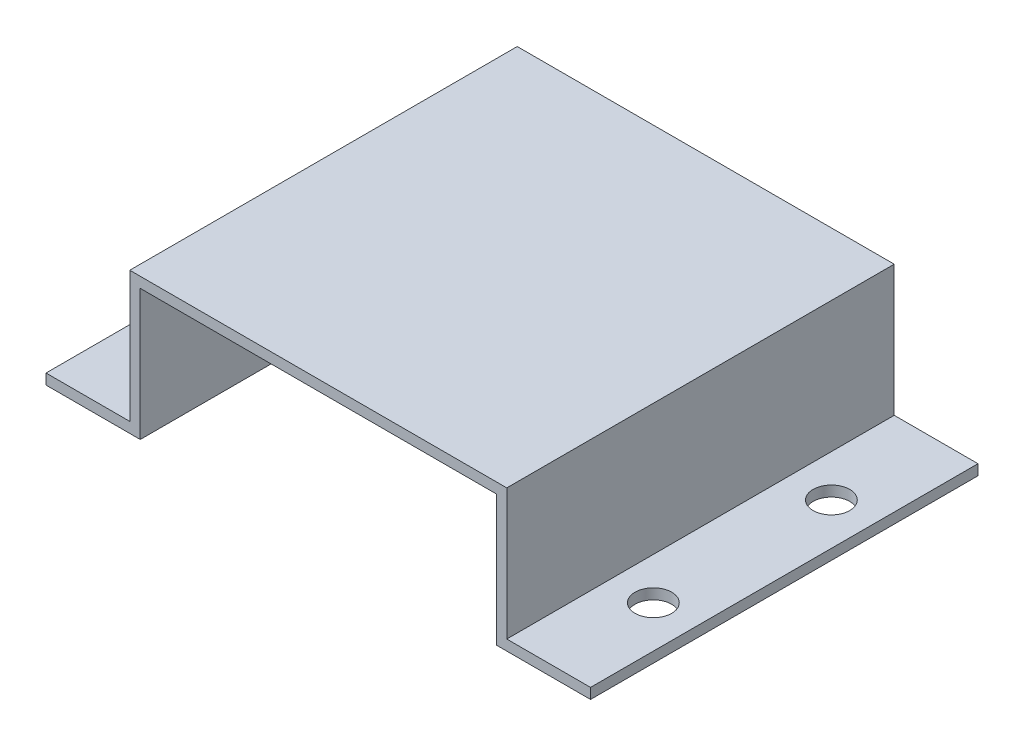
ISO-10303-21;
HEADER;
FILE_DESCRIPTION(('STEP AP214'),'2;1');
FILE_NAME('part.step','',(''),(''),'','','');
FILE_SCHEMA(('AUTOMOTIVE_DESIGN { 1 0 10303 214 1 1 1 1 }'));
ENDSEC;
DATA;
#1=APPLICATION_CONTEXT('core data for automotive mechanical design processes');
#2=APPLICATION_PROTOCOL_DEFINITION('international standard','automotive_design',2000,#1);
#3=PRODUCT_CONTEXT('',#1,'mechanical');
#4=PRODUCT('Part','Part','',(#3));
#5=PRODUCT_RELATED_PRODUCT_CATEGORY('part','',(#4));
#6=PRODUCT_DEFINITION_FORMATION('','',#4);
#7=PRODUCT_DEFINITION_CONTEXT('part definition',#1,'design');
#8=PRODUCT_DEFINITION('design','',#6,#7);
#9=PRODUCT_DEFINITION_SHAPE('','',#8);
#10=(LENGTH_UNIT() NAMED_UNIT(*) SI_UNIT(.MILLI.,.METRE.));
#11=(NAMED_UNIT(*) PLANE_ANGLE_UNIT() SI_UNIT($,.RADIAN.));
#12=(NAMED_UNIT(*) SI_UNIT($,.STERADIAN.) SOLID_ANGLE_UNIT());
#13=UNCERTAINTY_MEASURE_WITH_UNIT(LENGTH_MEASURE(1.E-05),#10,'distance_accuracy_value','');
#14=(GEOMETRIC_REPRESENTATION_CONTEXT(3) GLOBAL_UNCERTAINTY_ASSIGNED_CONTEXT((#13)) GLOBAL_UNIT_ASSIGNED_CONTEXT((#10,
#11,#12)) REPRESENTATION_CONTEXT('',''));
#15=CARTESIAN_POINT('',(0.,0.,0.));
#16=DIRECTION('',(0.,0.,1.));
#17=DIRECTION('',(1.,0.,0.));
#18=AXIS2_PLACEMENT_3D('',#15,#16,#17);
#19=CARTESIAN_POINT('',(0.,11.5,37.));
#20=DIRECTION('',(0.,1.,0.));
#21=DIRECTION('',(0.,0.,1.));
#22=AXIS2_PLACEMENT_3D('',#19,#20,#21);
#23=PLANE('',#22);
#24=DIRECTION('',(1.,0.,0.));
#25=VECTOR('',#24,1.);
#26=CARTESIAN_POINT('',(0.,11.5,0.));
#27=LINE('',#26,#25);
#28=CARTESIAN_POINT('',(0.999999999999999,11.5,0.));
#29=VERTEX_POINT('',#28);
#30=CARTESIAN_POINT('',(35.,11.5,0.));
#31=VERTEX_POINT('',#30);
#32=EDGE_CURVE('E161',#29,#31,#27,.T.);
#33=ORIENTED_EDGE('',*,*,#32,.T.);
#34=DIRECTION('',(0.,0.,-1.));
#35=VECTOR('',#34,1.);
#36=CARTESIAN_POINT('',(35.,11.5,37.));
#37=LINE('',#36,#35);
#38=CARTESIAN_POINT('',(35.,11.5,37.));
#39=VERTEX_POINT('',#38);
#40=EDGE_CURVE('E11',#39,#31,#37,.T.);
#41=ORIENTED_EDGE('',*,*,#40,.F.);
#42=DIRECTION('',(1.,0.,0.));
#43=VECTOR('',#42,1.);
#44=CARTESIAN_POINT('',(0.,11.5,37.));
#45=LINE('',#44,#43);
#46=CARTESIAN_POINT('',(0.999999999999999,11.5,37.));
#47=VERTEX_POINT('',#46);
#48=EDGE_CURVE('E191',#47,#39,#45,.T.);
#49=ORIENTED_EDGE('',*,*,#48,.F.);
#50=DIRECTION('',(0.,0.,-1.));
#51=VECTOR('',#50,1.);
#52=CARTESIAN_POINT('',(0.999999999999999,11.5,37.));
#53=LINE('',#52,#51);
#54=EDGE_CURVE('E157',#47,#29,#53,.T.);
#55=ORIENTED_EDGE('',*,*,#54,.T.);
#56=EDGE_LOOP('',(#33,#41,#49,#55));
#57=FACE_BOUND('',#56,.T.);
#58=ADVANCED_FACE('F38',(#57),#23,.F.);
#59=CARTESIAN_POINT('',(35.,0.,37.));
#60=DIRECTION('',(1.,0.,0.));
#61=DIRECTION('',(0.,0.,-1.));
#62=AXIS2_PLACEMENT_3D('',#59,#60,#61);
#63=PLANE('',#62);
#64=DIRECTION('',(0.,-1.,0.));
#65=VECTOR('',#64,1.);
#66=CARTESIAN_POINT('',(35.,0.,0.));
#67=LINE('',#66,#65);
#68=CARTESIAN_POINT('',(35.,-0.999999999999997,0.));
#69=VERTEX_POINT('',#68);
#70=EDGE_CURVE('E164',#31,#69,#67,.T.);
#71=ORIENTED_EDGE('',*,*,#70,.T.);
#72=DIRECTION('',(0.,0.,-1.));
#73=VECTOR('',#72,1.);
#74=CARTESIAN_POINT('',(35.,-0.999999999999997,37.));
#75=LINE('',#74,#73);
#76=CARTESIAN_POINT('',(35.,-0.999999999999997,37.));
#77=VERTEX_POINT('',#76);
#78=EDGE_CURVE('E47',#77,#69,#75,.T.);
#79=ORIENTED_EDGE('',*,*,#78,.F.);
#80=DIRECTION('',(0.,-1.,0.));
#81=VECTOR('',#80,1.);
#82=CARTESIAN_POINT('',(35.,0.,37.));
#83=LINE('',#82,#81);
#84=EDGE_CURVE('E111',#39,#77,#83,.T.);
#85=ORIENTED_EDGE('',*,*,#84,.F.);
#86=ORIENTED_EDGE('',*,*,#40,.T.);
#87=EDGE_LOOP('',(#71,#79,#85,#86));
#88=FACE_BOUND('',#87,.T.);
#89=ADVANCED_FACE('F275',(#88),#63,.F.);
#90=CARTESIAN_POINT('',(0.,-1.,37.));
#91=DIRECTION('',(0.,-1.,0.));
#92=DIRECTION('',(1.,0.,0.));
#93=AXIS2_PLACEMENT_3D('',#90,#91,#92);
#94=PLANE('',#93);
#95=CARTESIAN_POINT('',(40.,-0.999999999999997,10.));
#96=DIRECTION('',(0.,-1.,0.));
#97=DIRECTION('',(1.,0.,0.));
#98=AXIS2_PLACEMENT_3D('',#95,#96,#97);
#99=CIRCLE('',#98,1.75);
#100=CARTESIAN_POINT('',(41.75,-0.999999999999996,10.));
#101=VERTEX_POINT('',#100);
#102=EDGE_CURVE('E165',#101,#101,#99,.T.);
#103=ORIENTED_EDGE('',*,*,#102,.F.);
#104=EDGE_LOOP('',(#103));
#105=FACE_BOUND('',#104,.T.);
#106=CARTESIAN_POINT('',(40.,-0.999999999999997,27.));
#107=DIRECTION('',(0.,-1.,0.));
#108=DIRECTION('',(1.,0.,0.));
#109=AXIS2_PLACEMENT_3D('',#106,#107,#108);
#110=CIRCLE('',#109,1.75);
#111=CARTESIAN_POINT('',(41.75,-0.999999999999996,27.));
#112=VERTEX_POINT('',#111);
#113=EDGE_CURVE('E213',#112,#112,#110,.T.);
#114=ORIENTED_EDGE('',*,*,#113,.F.);
#115=EDGE_LOOP('',(#114));
#116=FACE_BOUND('',#115,.T.);
#117=DIRECTION('',(-1.,0.,0.));
#118=VECTOR('',#117,1.);
#119=CARTESIAN_POINT('',(0.,-1.,0.));
#120=LINE('',#119,#118);
#121=CARTESIAN_POINT('',(44.,-0.999999999999996,0.));
#122=VERTEX_POINT('',#121);
#123=EDGE_CURVE('E168',#122,#69,#120,.T.);
#124=ORIENTED_EDGE('',*,*,#123,.F.);
#125=DIRECTION('',(0.,0.,-1.));
#126=VECTOR('',#125,1.);
#127=CARTESIAN_POINT('',(44.,-0.999999999999996,37.));
#128=LINE('',#127,#126);
#129=CARTESIAN_POINT('',(44.,-0.999999999999996,37.));
#130=VERTEX_POINT('',#129);
#131=EDGE_CURVE('E205',#130,#122,#128,.T.);
#132=ORIENTED_EDGE('',*,*,#131,.F.);
#133=DIRECTION('',(-1.,0.,0.));
#134=VECTOR('',#133,1.);
#135=CARTESIAN_POINT('',(0.,-1.,37.));
#136=LINE('',#135,#134);
#137=EDGE_CURVE('E230',#130,#77,#136,.T.);
#138=ORIENTED_EDGE('',*,*,#137,.T.);
#139=ORIENTED_EDGE('',*,*,#78,.T.);
#140=EDGE_LOOP('',(#124,#132,#138,#139));
#141=FACE_BOUND('',#140,.T.);
#142=ADVANCED_FACE('F280',(#105,#116,#141),#94,.T.);
#143=CARTESIAN_POINT('',(44.,0.,37.));
#144=DIRECTION('',(1.,0.,0.));
#145=DIRECTION('',(0.,0.,-1.));
#146=AXIS2_PLACEMENT_3D('',#143,#144,#145);
#147=PLANE('',#146);
#148=DIRECTION('',(0.,-1.,0.));
#149=VECTOR('',#148,1.);
#150=CARTESIAN_POINT('',(44.,0.,0.));
#151=LINE('',#150,#149);
#152=CARTESIAN_POINT('',(44.,0.,0.));
#153=VERTEX_POINT('',#152);
#154=EDGE_CURVE('E171',#153,#122,#151,.T.);
#155=ORIENTED_EDGE('',*,*,#154,.F.);
#156=DIRECTION('',(0.,0.,-1.));
#157=VECTOR('',#156,1.);
#158=CARTESIAN_POINT('',(44.,0.,37.));
#159=LINE('',#158,#157);
#160=CARTESIAN_POINT('',(44.,0.,37.));
#161=VERTEX_POINT('',#160);
#162=EDGE_CURVE('E203',#161,#153,#159,.T.);
#163=ORIENTED_EDGE('',*,*,#162,.F.);
#164=DIRECTION('',(0.,-1.,0.));
#165=VECTOR('',#164,1.);
#166=CARTESIAN_POINT('',(44.,0.,37.));
#167=LINE('',#166,#165);
#168=EDGE_CURVE('E233',#161,#130,#167,.T.);
#169=ORIENTED_EDGE('',*,*,#168,.T.);
#170=ORIENTED_EDGE('',*,*,#131,.T.);
#171=EDGE_LOOP('',(#155,#163,#169,#170));
#172=FACE_BOUND('',#171,.T.);
#173=ADVANCED_FACE('F289',(#172),#147,.T.);
#174=CARTESIAN_POINT('',(0.,0.,37.));
#175=DIRECTION('',(0.,1.,0.));
#176=DIRECTION('',(0.,0.,1.));
#177=AXIS2_PLACEMENT_3D('',#174,#175,#176);
#178=PLANE('',#177);
#179=CARTESIAN_POINT('',(40.,0.,10.));
#180=DIRECTION('',(0.,1.,0.));
#181=DIRECTION('',(-1.,0.,0.));
#182=AXIS2_PLACEMENT_3D('',#179,#180,#181);
#183=CIRCLE('',#182,1.75);
#184=CARTESIAN_POINT('',(38.25,0.,10.));
#185=VERTEX_POINT('',#184);
#186=EDGE_CURVE('E220',#185,#185,#183,.T.);
#187=ORIENTED_EDGE('',*,*,#186,.F.);
#188=EDGE_LOOP('',(#187));
#189=FACE_BOUND('',#188,.T.);
#190=CARTESIAN_POINT('',(40.,0.,27.));
#191=DIRECTION('',(0.,1.,0.));
#192=DIRECTION('',(-1.,0.,0.));
#193=AXIS2_PLACEMENT_3D('',#190,#191,#192);
#194=CIRCLE('',#193,1.75);
#195=CARTESIAN_POINT('',(38.25,0.,27.));
#196=VERTEX_POINT('',#195);
#197=EDGE_CURVE('E323',#196,#196,#194,.T.);
#198=ORIENTED_EDGE('',*,*,#197,.F.);
#199=EDGE_LOOP('',(#198));
#200=FACE_BOUND('',#199,.T.);
#201=DIRECTION('',(1.,0.,0.));
#202=VECTOR('',#201,1.);
#203=CARTESIAN_POINT('',(0.,0.,0.));
#204=LINE('',#203,#202);
#205=CARTESIAN_POINT('',(36.,0.,0.));
#206=VERTEX_POINT('',#205);
#207=EDGE_CURVE('E174',#206,#153,#204,.T.);
#208=ORIENTED_EDGE('',*,*,#207,.F.);
#209=DIRECTION('',(0.,0.,-1.));
#210=VECTOR('',#209,1.);
#211=CARTESIAN_POINT('',(36.,0.,37.));
#212=LINE('',#211,#210);
#213=CARTESIAN_POINT('',(36.,0.,37.));
#214=VERTEX_POINT('',#213);
#215=EDGE_CURVE('E201',#214,#206,#212,.T.);
#216=ORIENTED_EDGE('',*,*,#215,.F.);
#217=DIRECTION('',(1.,0.,0.));
#218=VECTOR('',#217,1.);
#219=CARTESIAN_POINT('',(0.,0.,37.));
#220=LINE('',#219,#218);
#221=EDGE_CURVE('E236',#214,#161,#220,.T.);
#222=ORIENTED_EDGE('',*,*,#221,.T.);
#223=ORIENTED_EDGE('',*,*,#162,.T.);
#224=EDGE_LOOP('',(#208,#216,#222,#223));
#225=FACE_BOUND('',#224,.T.);
#226=ADVANCED_FACE('F292',(#189,#200,#225),#178,.T.);
#227=CARTESIAN_POINT('',(36.,0.,37.));
#228=DIRECTION('',(1.,0.,0.));
#229=DIRECTION('',(0.,0.,-1.));
#230=AXIS2_PLACEMENT_3D('',#227,#228,#229);
#231=PLANE('',#230);
#232=DIRECTION('',(0.,-1.,0.));
#233=VECTOR('',#232,1.);
#234=CARTESIAN_POINT('',(36.,0.,0.));
#235=LINE('',#234,#233);
#236=CARTESIAN_POINT('',(36.,12.5,0.));
#237=VERTEX_POINT('',#236);
#238=EDGE_CURVE('E177',#237,#206,#235,.T.);
#239=ORIENTED_EDGE('',*,*,#238,.F.);
#240=DIRECTION('',(0.,0.,-1.));
#241=VECTOR('',#240,1.);
#242=CARTESIAN_POINT('',(36.,12.5,37.));
#243=LINE('',#242,#241);
#244=CARTESIAN_POINT('',(36.,12.5,37.));
#245=VERTEX_POINT('',#244);
#246=EDGE_CURVE('E199',#245,#237,#243,.T.);
#247=ORIENTED_EDGE('',*,*,#246,.F.);
#248=DIRECTION('',(0.,-1.,0.));
#249=VECTOR('',#248,1.);
#250=CARTESIAN_POINT('',(36.,0.,37.));
#251=LINE('',#250,#249);
#252=EDGE_CURVE('E239',#245,#214,#251,.T.);
#253=ORIENTED_EDGE('',*,*,#252,.T.);
#254=ORIENTED_EDGE('',*,*,#215,.T.);
#255=EDGE_LOOP('',(#239,#247,#253,#254));
#256=FACE_BOUND('',#255,.T.);
#257=ADVANCED_FACE('F294',(#256),#231,.T.);
#258=CARTESIAN_POINT('',(0.,12.5,37.));
#259=DIRECTION('',(0.,1.,0.));
#260=DIRECTION('',(0.,0.,1.));
#261=AXIS2_PLACEMENT_3D('',#258,#259,#260);
#262=PLANE('',#261);
#263=DIRECTION('',(1.,0.,0.));
#264=VECTOR('',#263,1.);
#265=CARTESIAN_POINT('',(0.,12.5,0.));
#266=LINE('',#265,#264);
#267=CARTESIAN_POINT('',(0.,12.5,0.));
#268=VERTEX_POINT('',#267);
#269=EDGE_CURVE('E180',#268,#237,#266,.T.);
#270=ORIENTED_EDGE('',*,*,#269,.F.);
#271=DIRECTION('',(0.,0.,-1.));
#272=VECTOR('',#271,1.);
#273=CARTESIAN_POINT('',(0.,12.5,37.));
#274=LINE('',#273,#272);
#275=CARTESIAN_POINT('',(0.,12.5,37.));
#276=VERTEX_POINT('',#275);
#277=EDGE_CURVE('E197',#276,#268,#274,.T.);
#278=ORIENTED_EDGE('',*,*,#277,.F.);
#279=DIRECTION('',(1.,0.,0.));
#280=VECTOR('',#279,1.);
#281=CARTESIAN_POINT('',(0.,12.5,37.));
#282=LINE('',#281,#280);
#283=EDGE_CURVE('E242',#276,#245,#282,.T.);
#284=ORIENTED_EDGE('',*,*,#283,.T.);
#285=ORIENTED_EDGE('',*,*,#246,.T.);
#286=EDGE_LOOP('',(#270,#278,#284,#285));
#287=FACE_BOUND('',#286,.T.);
#288=ADVANCED_FACE('F255',(#287),#262,.T.);
#289=CARTESIAN_POINT('',(0.,0.,37.));
#290=DIRECTION('',(-1.,0.,0.));
#291=DIRECTION('',(0.,0.,1.));
#292=AXIS2_PLACEMENT_3D('',#289,#290,#291);
#293=PLANE('',#292);
#294=DIRECTION('',(0.,1.,0.));
#295=VECTOR('',#294,1.);
#296=CARTESIAN_POINT('',(0.,0.,0.));
#297=LINE('',#296,#295);
#298=CARTESIAN_POINT('',(0.,0.,0.));
#299=VERTEX_POINT('',#298);
#300=EDGE_CURVE('E183',#299,#268,#297,.T.);
#301=ORIENTED_EDGE('',*,*,#300,.F.);
#302=DIRECTION('',(0.,0.,-1.));
#303=VECTOR('',#302,1.);
#304=CARTESIAN_POINT('',(0.,0.,37.));
#305=LINE('',#304,#303);
#306=CARTESIAN_POINT('',(0.,0.,37.));
#307=VERTEX_POINT('',#306);
#308=EDGE_CURVE('E195',#307,#299,#305,.T.);
#309=ORIENTED_EDGE('',*,*,#308,.F.);
#310=DIRECTION('',(0.,1.,0.));
#311=VECTOR('',#310,1.);
#312=CARTESIAN_POINT('',(0.,0.,37.));
#313=LINE('',#312,#311);
#314=EDGE_CURVE('E245',#307,#276,#313,.T.);
#315=ORIENTED_EDGE('',*,*,#314,.T.);
#316=ORIENTED_EDGE('',*,*,#277,.T.);
#317=EDGE_LOOP('',(#301,#309,#315,#316));
#318=FACE_BOUND('',#317,.T.);
#319=ADVANCED_FACE('F249',(#318),#293,.T.);
#320=CARTESIAN_POINT('',(0.,0.,37.));
#321=DIRECTION('',(0.,-1.,0.));
#322=DIRECTION('',(1.,0.,0.));
#323=AXIS2_PLACEMENT_3D('',#320,#321,#322);
#324=PLANE('',#323);
#325=CARTESIAN_POINT('',(-4.,0.,27.));
#326=DIRECTION('',(0.,1.,0.));
#327=DIRECTION('',(-1.,0.,0.));
#328=AXIS2_PLACEMENT_3D('',#325,#326,#327);
#329=CIRCLE('',#328,1.75);
#330=CARTESIAN_POINT('',(-5.75,0.,27.));
#331=VERTEX_POINT('',#330);
#332=EDGE_CURVE('E215',#331,#331,#329,.T.);
#333=ORIENTED_EDGE('',*,*,#332,.F.);
#334=EDGE_LOOP('',(#333));
#335=FACE_BOUND('',#334,.T.);
#336=CARTESIAN_POINT('',(-4.,0.,10.));
#337=DIRECTION('',(0.,1.,0.));
#338=DIRECTION('',(-1.,0.,0.));
#339=AXIS2_PLACEMENT_3D('',#336,#337,#338);
#340=CIRCLE('',#339,1.75);
#341=CARTESIAN_POINT('',(-5.75,0.,10.));
#342=VERTEX_POINT('',#341);
#343=EDGE_CURVE('E209',#342,#342,#340,.T.);
#344=ORIENTED_EDGE('',*,*,#343,.F.);
#345=EDGE_LOOP('',(#344));
#346=FACE_BOUND('',#345,.T.);
#347=DIRECTION('',(-1.,0.,0.));
#348=VECTOR('',#347,1.);
#349=CARTESIAN_POINT('',(0.,0.,0.));
#350=LINE('',#349,#348);
#351=CARTESIAN_POINT('',(-8.,0.,0.));
#352=VERTEX_POINT('',#351);
#353=EDGE_CURVE('E186',#299,#352,#350,.T.);
#354=ORIENTED_EDGE('',*,*,#353,.T.);
#355=DIRECTION('',(0.,0.,-1.));
#356=VECTOR('',#355,1.);
#357=CARTESIAN_POINT('',(-8.,0.,37.));
#358=LINE('',#357,#356);
#359=CARTESIAN_POINT('',(-8.,0.,37.));
#360=VERTEX_POINT('',#359);
#361=EDGE_CURVE('E152',#360,#352,#358,.T.);
#362=ORIENTED_EDGE('',*,*,#361,.F.);
#363=DIRECTION('',(-1.,0.,0.));
#364=VECTOR('',#363,1.);
#365=CARTESIAN_POINT('',(0.,0.,37.));
#366=LINE('',#365,#364);
#367=EDGE_CURVE('E143',#307,#360,#366,.T.);
#368=ORIENTED_EDGE('',*,*,#367,.F.);
#369=ORIENTED_EDGE('',*,*,#308,.T.);
#370=EDGE_LOOP('',(#354,#362,#368,#369));
#371=FACE_BOUND('',#370,.T.);
#372=ADVANCED_FACE('F262',(#335,#346,#371),#324,.F.);
#373=CARTESIAN_POINT('',(-8.,0.,37.));
#374=DIRECTION('',(1.,0.,0.));
#375=DIRECTION('',(0.,0.,-1.));
#376=AXIS2_PLACEMENT_3D('',#373,#374,#375);
#377=PLANE('',#376);
#378=DIRECTION('',(0.,-1.,0.));
#379=VECTOR('',#378,1.);
#380=CARTESIAN_POINT('',(-8.,0.,0.));
#381=LINE('',#380,#379);
#382=CARTESIAN_POINT('',(-8.,-1.,0.));
#383=VERTEX_POINT('',#382);
#384=EDGE_CURVE('E151',#352,#383,#381,.T.);
#385=ORIENTED_EDGE('',*,*,#384,.T.);
#386=DIRECTION('',(0.,0.,-1.));
#387=VECTOR('',#386,1.);
#388=CARTESIAN_POINT('',(-8.,-1.,37.));
#389=LINE('',#388,#387);
#390=CARTESIAN_POINT('',(-8.,-1.,37.));
#391=VERTEX_POINT('',#390);
#392=EDGE_CURVE('E148',#391,#383,#389,.T.);
#393=ORIENTED_EDGE('',*,*,#392,.F.);
#394=DIRECTION('',(0.,-1.,0.));
#395=VECTOR('',#394,1.);
#396=CARTESIAN_POINT('',(-8.,0.,37.));
#397=LINE('',#396,#395);
#398=EDGE_CURVE('E136',#360,#391,#397,.T.);
#399=ORIENTED_EDGE('',*,*,#398,.F.);
#400=ORIENTED_EDGE('',*,*,#361,.T.);
#401=EDGE_LOOP('',(#385,#393,#399,#400));
#402=FACE_BOUND('',#401,.T.);
#403=ADVANCED_FACE('F149',(#402),#377,.F.);
#404=CARTESIAN_POINT('',(0.,-1.,37.));
#405=DIRECTION('',(0.,1.,0.));
#406=DIRECTION('',(0.,0.,1.));
#407=AXIS2_PLACEMENT_3D('',#404,#405,#406);
#408=PLANE('',#407);
#409=CARTESIAN_POINT('',(-4.,-1.,27.));
#410=DIRECTION('',(0.,1.,0.));
#411=DIRECTION('',(0.,0.,1.));
#412=AXIS2_PLACEMENT_3D('',#409,#410,#411);
#413=CIRCLE('',#412,1.75);
#414=CARTESIAN_POINT('',(-4.,-1.,28.75));
#415=VERTEX_POINT('',#414);
#416=EDGE_CURVE('E41',#415,#415,#413,.T.);
#417=ORIENTED_EDGE('',*,*,#416,.T.);
#418=EDGE_LOOP('',(#417));
#419=FACE_BOUND('',#418,.T.);
#420=CARTESIAN_POINT('',(-4.,-1.,10.));
#421=DIRECTION('',(0.,1.,0.));
#422=DIRECTION('',(0.,0.,1.));
#423=AXIS2_PLACEMENT_3D('',#420,#421,#422);
#424=CIRCLE('',#423,1.75);
#425=CARTESIAN_POINT('',(-4.,-1.,11.75));
#426=VERTEX_POINT('',#425);
#427=EDGE_CURVE('E207',#426,#426,#424,.T.);
#428=ORIENTED_EDGE('',*,*,#427,.T.);
#429=EDGE_LOOP('',(#428));
#430=FACE_BOUND('',#429,.T.);
#431=DIRECTION('',(1.,0.,0.));
#432=VECTOR('',#431,1.);
#433=CARTESIAN_POINT('',(0.,-1.,0.));
#434=LINE('',#433,#432);
#435=CARTESIAN_POINT('',(0.999999999999999,-1.,0.));
#436=VERTEX_POINT('',#435);
#437=EDGE_CURVE('E97',#383,#436,#434,.T.);
#438=ORIENTED_EDGE('',*,*,#437,.T.);
#439=DIRECTION('',(0.,0.,-1.));
#440=VECTOR('',#439,1.);
#441=CARTESIAN_POINT('',(0.999999999999999,-1.,37.));
#442=LINE('',#441,#440);
#443=CARTESIAN_POINT('',(0.999999999999999,-1.,37.));
#444=VERTEX_POINT('',#443);
#445=EDGE_CURVE('E153',#444,#436,#442,.T.);
#446=ORIENTED_EDGE('',*,*,#445,.F.);
#447=DIRECTION('',(1.,0.,0.));
#448=VECTOR('',#447,1.);
#449=CARTESIAN_POINT('',(0.,-1.,37.));
#450=LINE('',#449,#448);
#451=EDGE_CURVE('E140',#391,#444,#450,.T.);
#452=ORIENTED_EDGE('',*,*,#451,.F.);
#453=ORIENTED_EDGE('',*,*,#392,.T.);
#454=EDGE_LOOP('',(#438,#446,#452,#453));
#455=FACE_BOUND('',#454,.T.);
#456=ADVANCED_FACE('F155',(#419,#430,#455),#408,.F.);
#457=CARTESIAN_POINT('',(0.999999999999999,0.,37.));
#458=DIRECTION('',(-1.,0.,0.));
#459=DIRECTION('',(0.,0.,1.));
#460=AXIS2_PLACEMENT_3D('',#457,#458,#459);
#461=PLANE('',#460);
#462=DIRECTION('',(0.,1.,0.));
#463=VECTOR('',#462,1.);
#464=CARTESIAN_POINT('',(0.999999999999999,0.,0.));
#465=LINE('',#464,#463);
#466=EDGE_CURVE('E103',#436,#29,#465,.T.);
#467=ORIENTED_EDGE('',*,*,#466,.T.);
#468=ORIENTED_EDGE('',*,*,#54,.F.);
#469=DIRECTION('',(0.,1.,0.));
#470=VECTOR('',#469,1.);
#471=CARTESIAN_POINT('',(0.999999999999999,0.,37.));
#472=LINE('',#471,#470);
#473=EDGE_CURVE('E56',#444,#47,#472,.T.);
#474=ORIENTED_EDGE('',*,*,#473,.F.);
#475=ORIENTED_EDGE('',*,*,#445,.T.);
#476=EDGE_LOOP('',(#467,#468,#474,#475));
#477=FACE_BOUND('',#476,.T.);
#478=ADVANCED_FACE('F341',(#477),#461,.F.);
#479=CARTESIAN_POINT('',(0.,0.,37.));
#480=DIRECTION('',(0.,0.,1.));
#481=DIRECTION('',(1.,0.,0.));
#482=AXIS2_PLACEMENT_3D('',#479,#480,#481);
#483=PLANE('',#482);
#484=ORIENTED_EDGE('',*,*,#48,.T.);
#485=ORIENTED_EDGE('',*,*,#84,.T.);
#486=ORIENTED_EDGE('',*,*,#137,.F.);
#487=ORIENTED_EDGE('',*,*,#168,.F.);
#488=ORIENTED_EDGE('',*,*,#221,.F.);
#489=ORIENTED_EDGE('',*,*,#252,.F.);
#490=ORIENTED_EDGE('',*,*,#283,.F.);
#491=ORIENTED_EDGE('',*,*,#314,.F.);
#492=ORIENTED_EDGE('',*,*,#367,.T.);
#493=ORIENTED_EDGE('',*,*,#398,.T.);
#494=ORIENTED_EDGE('',*,*,#451,.T.);
#495=ORIENTED_EDGE('',*,*,#473,.T.);
#496=EDGE_LOOP('',(#484,#485,#486,#487,#488,#489,#490,#491,#492,#493,#494,#495));
#497=FACE_BOUND('',#496,.T.);
#498=ADVANCED_FACE('F138',(#497),#483,.T.);
#499=CARTESIAN_POINT('',(0.,0.,0.));
#500=DIRECTION('',(0.,0.,1.));
#501=DIRECTION('',(1.,0.,0.));
#502=AXIS2_PLACEMENT_3D('',#499,#500,#501);
#503=PLANE('',#502);
#504=ORIENTED_EDGE('',*,*,#32,.F.);
#505=ORIENTED_EDGE('',*,*,#466,.F.);
#506=ORIENTED_EDGE('',*,*,#437,.F.);
#507=ORIENTED_EDGE('',*,*,#384,.F.);
#508=ORIENTED_EDGE('',*,*,#353,.F.);
#509=ORIENTED_EDGE('',*,*,#300,.T.);
#510=ORIENTED_EDGE('',*,*,#269,.T.);
#511=ORIENTED_EDGE('',*,*,#238,.T.);
#512=ORIENTED_EDGE('',*,*,#207,.T.);
#513=ORIENTED_EDGE('',*,*,#154,.T.);
#514=ORIENTED_EDGE('',*,*,#123,.T.);
#515=ORIENTED_EDGE('',*,*,#70,.F.);
#516=EDGE_LOOP('',(#504,#505,#506,#507,#508,#509,#510,#511,#512,#513,#514,#515));
#517=FACE_BOUND('',#516,.T.);
#518=ADVANCED_FACE('F260',(#517),#503,.F.);
#519=CARTESIAN_POINT('',(-4.,-6.,10.));
#520=DIRECTION('',(0.,1.,0.));
#521=DIRECTION('',(-1.,0.,0.));
#522=AXIS2_PLACEMENT_3D('',#519,#520,#521);
#523=CYLINDRICAL_SURFACE('',#522,1.75);
#524=ORIENTED_EDGE('',*,*,#343,.T.);
#525=EDGE_LOOP('',(#524));
#526=FACE_BOUND('',#525,.T.);
#527=ORIENTED_EDGE('',*,*,#427,.F.);
#528=EDGE_LOOP('',(#527));
#529=FACE_BOUND('',#528,.T.);
#530=ADVANCED_FACE('F336',(#526,#529),#523,.F.);
#531=CARTESIAN_POINT('',(-4.,-6.,27.));
#532=DIRECTION('',(0.,1.,0.));
#533=DIRECTION('',(-1.,0.,0.));
#534=AXIS2_PLACEMENT_3D('',#531,#532,#533);
#535=CYLINDRICAL_SURFACE('',#534,1.75);
#536=ORIENTED_EDGE('',*,*,#332,.T.);
#537=EDGE_LOOP('',(#536));
#538=FACE_BOUND('',#537,.T.);
#539=ORIENTED_EDGE('',*,*,#416,.F.);
#540=EDGE_LOOP('',(#539));
#541=FACE_BOUND('',#540,.T.);
#542=ADVANCED_FACE('F319',(#538,#541),#535,.F.);
#543=CARTESIAN_POINT('',(40.,-5.99999999999999,27.));
#544=DIRECTION('',(0.,1.,0.));
#545=DIRECTION('',(-1.,0.,0.));
#546=AXIS2_PLACEMENT_3D('',#543,#544,#545);
#547=CYLINDRICAL_SURFACE('',#546,1.75);
#548=ORIENTED_EDGE('',*,*,#113,.T.);
#549=EDGE_LOOP('',(#548));
#550=FACE_BOUND('',#549,.T.);
#551=ORIENTED_EDGE('',*,*,#197,.T.);
#552=EDGE_LOOP('',(#551));
#553=FACE_BOUND('',#552,.T.);
#554=ADVANCED_FACE('F315',(#550,#553),#547,.F.);
#555=CARTESIAN_POINT('',(40.,-5.99999999999999,10.));
#556=DIRECTION('',(0.,1.,0.));
#557=DIRECTION('',(-1.,0.,0.));
#558=AXIS2_PLACEMENT_3D('',#555,#556,#557);
#559=CYLINDRICAL_SURFACE('',#558,1.75);
#560=ORIENTED_EDGE('',*,*,#102,.T.);
#561=EDGE_LOOP('',(#560));
#562=FACE_BOUND('',#561,.T.);
#563=ORIENTED_EDGE('',*,*,#186,.T.);
#564=EDGE_LOOP('',(#563));
#565=FACE_BOUND('',#564,.T.);
#566=ADVANCED_FACE('F318',(#562,#565),#559,.F.);
#567=CLOSED_SHELL('',(#58,#89,#142,#173,#226,#257,#288,#319,#372,#403,#456,#478,#498,#518,#530,
#542,#554,#566));
#568=MANIFOLD_SOLID_BREP('B2',#567);
#569=ADVANCED_BREP_SHAPE_REPRESENTATION('',(#18,#568),#14);
#570=SHAPE_DEFINITION_REPRESENTATION(#9,#569);
ENDSEC;
END-ISO-10303-21;
